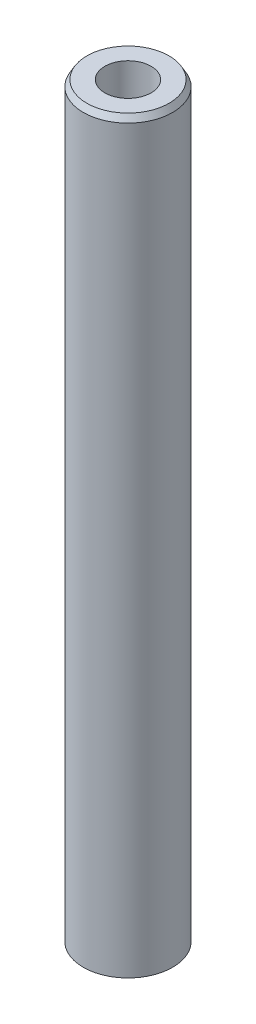
ISO-10303-21;
HEADER;
FILE_DESCRIPTION(('STEP AP214'),'2;1');
FILE_NAME('part.step','',(''),(''),'','','');
FILE_SCHEMA(('AUTOMOTIVE_DESIGN { 1 0 10303 214 1 1 1 1 }'));
ENDSEC;
DATA;
#1=APPLICATION_CONTEXT('core data for automotive mechanical design processes');
#2=APPLICATION_PROTOCOL_DEFINITION('international standard','automotive_design',2000,#1);
#3=PRODUCT_CONTEXT('',#1,'mechanical');
#4=PRODUCT('Part','Part','',(#3));
#5=PRODUCT_RELATED_PRODUCT_CATEGORY('part','',(#4));
#6=PRODUCT_DEFINITION_FORMATION('','',#4);
#7=PRODUCT_DEFINITION_CONTEXT('part definition',#1,'design');
#8=PRODUCT_DEFINITION('design','',#6,#7);
#9=PRODUCT_DEFINITION_SHAPE('','',#8);
#10=(LENGTH_UNIT() NAMED_UNIT(*) SI_UNIT(.MILLI.,.METRE.));
#11=(NAMED_UNIT(*) PLANE_ANGLE_UNIT() SI_UNIT($,.RADIAN.));
#12=(NAMED_UNIT(*) SI_UNIT($,.STERADIAN.) SOLID_ANGLE_UNIT());
#13=UNCERTAINTY_MEASURE_WITH_UNIT(LENGTH_MEASURE(1.E-05),#10,'distance_accuracy_value','');
#14=(GEOMETRIC_REPRESENTATION_CONTEXT(3) GLOBAL_UNCERTAINTY_ASSIGNED_CONTEXT((#13)) GLOBAL_UNIT_ASSIGNED_CONTEXT((#10,
#11,#12)) REPRESENTATION_CONTEXT('',''));
#15=CARTESIAN_POINT('',(0.,0.,0.));
#16=DIRECTION('',(0.,0.,1.));
#17=DIRECTION('',(1.,0.,0.));
#18=AXIS2_PLACEMENT_3D('',#15,#16,#17);
#19=CARTESIAN_POINT('',(0.,167.920377101874,0.));
#20=DIRECTION('',(0.,-1.,0.));
#21=DIRECTION('',(0.,0.,-1.));
#22=AXIS2_PLACEMENT_3D('',#19,#20,#21);
#23=CYLINDRICAL_SURFACE('',#22,10.);
#24=CARTESIAN_POINT('',(0.,166.539221278618,0.));
#25=DIRECTION('',(0.,1.,0.));
#26=DIRECTION('',(0.,0.,1.));
#27=AXIS2_PLACEMENT_3D('',#24,#25,#26);
#28=CIRCLE('',#27,10.);
#29=CARTESIAN_POINT('',(0.,166.539221278618,10.));
#30=VERTEX_POINT('',#29);
#31=EDGE_CURVE('E50',#30,#30,#28,.F.);
#32=ORIENTED_EDGE('',*,*,#31,.T.);
#33=EDGE_LOOP('',(#32));
#34=FACE_BOUND('',#33,.T.);
#35=CARTESIAN_POINT('',(0.,0.797410686349309,0.));
#36=DIRECTION('',(0.,1.,0.));
#37=DIRECTION('',(0.,0.,1.));
#38=AXIS2_PLACEMENT_3D('',#35,#36,#37);
#39=CIRCLE('',#38,10.);
#40=CARTESIAN_POINT('',(0.,0.797410686349309,10.));
#41=VERTEX_POINT('',#40);
#42=EDGE_CURVE('E51',#41,#41,#39,.T.);
#43=ORIENTED_EDGE('',*,*,#42,.T.);
#44=EDGE_LOOP('',(#43));
#45=FACE_BOUND('',#44,.T.);
#46=ADVANCED_FACE('F39',(#34,#45),#23,.T.);
#47=CARTESIAN_POINT('',(0.,167.920377101874,0.));
#48=DIRECTION('',(0.,1.,0.));
#49=DIRECTION('',(0.,0.,1.));
#50=AXIS2_PLACEMENT_3D('',#47,#48,#49);
#51=PLANE('',#50);
#52=CARTESIAN_POINT('',(0.,167.920377101874,0.));
#53=DIRECTION('',(0.,1.,0.));
#54=DIRECTION('',(0.,0.,1.));
#55=AXIS2_PLACEMENT_3D('',#52,#53,#54);
#56=CIRCLE('',#55,9.20258931365069);
#57=CARTESIAN_POINT('',(0.,167.920377101874,9.20258931365069));
#58=VERTEX_POINT('',#57);
#59=EDGE_CURVE('E54',#58,#58,#56,.T.);
#60=ORIENTED_EDGE('',*,*,#59,.T.);
#61=EDGE_LOOP('',(#60));
#62=FACE_BOUND('',#61,.T.);
#63=CARTESIAN_POINT('',(0.,167.920377101874,0.));
#64=DIRECTION('',(0.,1.,0.));
#65=DIRECTION('',(0.,0.,1.));
#66=AXIS2_PLACEMENT_3D('',#63,#64,#65);
#67=CIRCLE('',#66,5.17126994496889);
#68=CARTESIAN_POINT('',(0.,167.920377101874,5.17126994496889));
#69=VERTEX_POINT('',#68);
#70=EDGE_CURVE('E58',#69,#69,#67,.T.);
#71=ORIENTED_EDGE('',*,*,#70,.F.);
#72=EDGE_LOOP('',(#71));
#73=FACE_BOUND('',#72,.T.);
#74=ADVANCED_FACE('F69',(#62,#73),#51,.T.);
#75=CARTESIAN_POINT('',(0.,0.,0.));
#76=DIRECTION('',(0.,1.,0.));
#77=DIRECTION('',(0.,0.,1.));
#78=AXIS2_PLACEMENT_3D('',#75,#76,#77);
#79=PLANE('',#78);
#80=CARTESIAN_POINT('',(0.,0.,0.));
#81=DIRECTION('',(0.,1.,0.));
#82=DIRECTION('',(0.,0.,1.));
#83=AXIS2_PLACEMENT_3D('',#80,#81,#82);
#84=CIRCLE('',#83,8.61884417674461);
#85=CARTESIAN_POINT('',(0.,0.,8.61884417674461));
#86=VERTEX_POINT('',#85);
#87=EDGE_CURVE('E10',#86,#86,#84,.F.);
#88=ORIENTED_EDGE('',*,*,#87,.T.);
#89=EDGE_LOOP('',(#88));
#90=FACE_BOUND('',#89,.T.);
#91=CARTESIAN_POINT('',(0.,0.,0.));
#92=DIRECTION('',(0.,1.,0.));
#93=DIRECTION('',(0.,0.,1.));
#94=AXIS2_PLACEMENT_3D('',#91,#92,#93);
#95=CIRCLE('',#94,5.17126994496889);
#96=CARTESIAN_POINT('',(0.,0.,5.17126994496889));
#97=VERTEX_POINT('',#96);
#98=EDGE_CURVE('E63',#97,#97,#95,.T.);
#99=ORIENTED_EDGE('',*,*,#98,.T.);
#100=EDGE_LOOP('',(#99));
#101=FACE_BOUND('',#100,.T.);
#102=ADVANCED_FACE('F75',(#90,#101),#79,.F.);
#103=CARTESIAN_POINT('',(0.,167.920377101874,0.));
#104=DIRECTION('',(0.,-1.,0.));
#105=DIRECTION('',(0.,0.,-1.));
#106=AXIS2_PLACEMENT_3D('',#103,#104,#105);
#107=CYLINDRICAL_SURFACE('',#106,5.17126994496889);
#108=ORIENTED_EDGE('',*,*,#70,.T.);
#109=EDGE_LOOP('',(#108));
#110=FACE_BOUND('',#109,.T.);
#111=ORIENTED_EDGE('',*,*,#98,.F.);
#112=EDGE_LOOP('',(#111));
#113=FACE_BOUND('',#112,.T.);
#114=ADVANCED_FACE('F70',(#110,#113),#107,.F.);
#115=CARTESIAN_POINT('',(0.,167.920377101874,0.));
#116=DIRECTION('',(0.,-1.,0.));
#117=DIRECTION('',(0.,0.,-1.));
#118=AXIS2_PLACEMENT_3D('',#115,#116,#117);
#119=CONICAL_SURFACE('',#118,9.20258931365069,0.523598775598292);
#120=ORIENTED_EDGE('',*,*,#31,.F.);
#121=EDGE_LOOP('',(#120));
#122=FACE_BOUND('',#121,.T.);
#123=ORIENTED_EDGE('',*,*,#59,.F.);
#124=EDGE_LOOP('',(#123));
#125=FACE_BOUND('',#124,.T.);
#126=ADVANCED_FACE('F81',(#122,#125),#119,.T.);
#127=CARTESIAN_POINT('',(0.,0.797410686349309,0.));
#128=DIRECTION('',(0.,1.,0.));
#129=DIRECTION('',(0.,0.,1.));
#130=AXIS2_PLACEMENT_3D('',#127,#128,#129);
#131=CONICAL_SURFACE('',#130,10.,1.0471975511966);
#132=ORIENTED_EDGE('',*,*,#87,.F.);
#133=EDGE_LOOP('',(#132));
#134=FACE_BOUND('',#133,.T.);
#135=ORIENTED_EDGE('',*,*,#42,.F.);
#136=EDGE_LOOP('',(#135));
#137=FACE_BOUND('',#136,.T.);
#138=ADVANCED_FACE('F45',(#134,#137),#131,.T.);
#139=CLOSED_SHELL('',(#46,#74,#102,#114,#126,#138));
#140=MANIFOLD_SOLID_BREP('B2',#139);
#141=ADVANCED_BREP_SHAPE_REPRESENTATION('',(#18,#140),#14);
#142=SHAPE_DEFINITION_REPRESENTATION(#9,#141);
ENDSEC;
END-ISO-10303-21;
